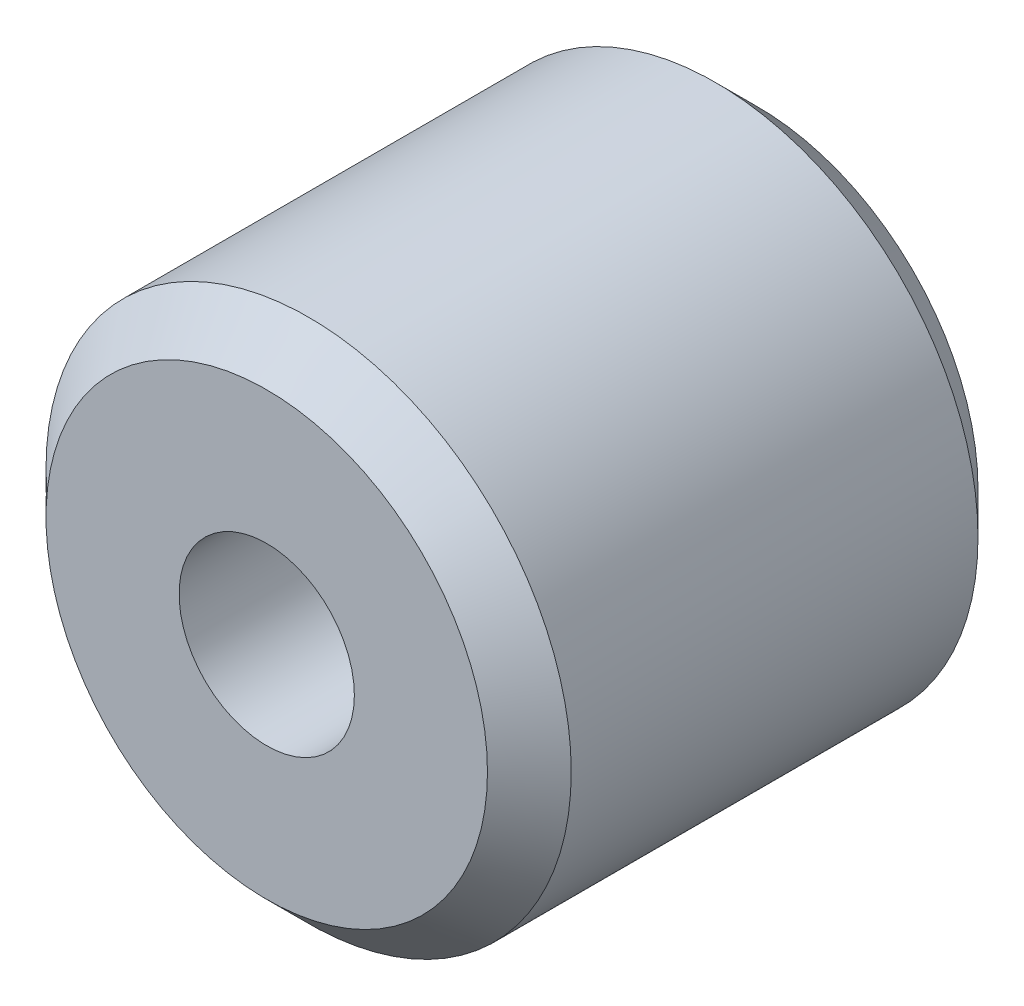
ISO-10303-21;
HEADER;
FILE_DESCRIPTION(('STEP AP214'),'2;1');
FILE_NAME('part.step','',(''),(''),'','','');
FILE_SCHEMA(('AUTOMOTIVE_DESIGN { 1 0 10303 214 1 1 1 1 }'));
ENDSEC;
DATA;
#1=APPLICATION_CONTEXT('core data for automotive mechanical design processes');
#2=APPLICATION_PROTOCOL_DEFINITION('international standard','automotive_design',2000,#1);
#3=PRODUCT_CONTEXT('',#1,'mechanical');
#4=PRODUCT('Part','Part','',(#3));
#5=PRODUCT_RELATED_PRODUCT_CATEGORY('part','',(#4));
#6=PRODUCT_DEFINITION_FORMATION('','',#4);
#7=PRODUCT_DEFINITION_CONTEXT('part definition',#1,'design');
#8=PRODUCT_DEFINITION('design','',#6,#7);
#9=PRODUCT_DEFINITION_SHAPE('','',#8);
#10=(LENGTH_UNIT() NAMED_UNIT(*) SI_UNIT(.MILLI.,.METRE.));
#11=(NAMED_UNIT(*) PLANE_ANGLE_UNIT() SI_UNIT($,.RADIAN.));
#12=(NAMED_UNIT(*) SI_UNIT($,.STERADIAN.) SOLID_ANGLE_UNIT());
#13=UNCERTAINTY_MEASURE_WITH_UNIT(LENGTH_MEASURE(1.E-05),#10,'distance_accuracy_value','');
#14=(GEOMETRIC_REPRESENTATION_CONTEXT(3) GLOBAL_UNCERTAINTY_ASSIGNED_CONTEXT((#13)) GLOBAL_UNIT_ASSIGNED_CONTEXT((#10,
#11,#12)) REPRESENTATION_CONTEXT('',''));
#15=CARTESIAN_POINT('',(0.,0.,0.));
#16=DIRECTION('',(0.,0.,1.));
#17=DIRECTION('',(1.,0.,0.));
#18=AXIS2_PLACEMENT_3D('',#15,#16,#17);
#19=CARTESIAN_POINT('',(0.,0.,4.45));
#20=DIRECTION('',(0.,0.,1.));
#21=DIRECTION('',(1.,0.,0.));
#22=AXIS2_PLACEMENT_3D('',#19,#20,#21);
#23=PLANE('',#22);
#24=CARTESIAN_POINT('',(0.,0.,4.45));
#25=DIRECTION('',(0.,0.,1.));
#26=DIRECTION('',(1.,0.,0.));
#27=AXIS2_PLACEMENT_3D('',#24,#25,#26);
#28=CIRCLE('',#27,4.005);
#29=CARTESIAN_POINT('',(4.005,0.,4.45));
#30=VERTEX_POINT('',#29);
#31=EDGE_CURVE('E10',#30,#30,#28,.T.);
#32=ORIENTED_EDGE('',*,*,#31,.T.);
#33=EDGE_LOOP('',(#32));
#34=FACE_BOUND('',#33,.T.);
#35=CARTESIAN_POINT('',(0.,0.,4.45));
#36=DIRECTION('',(0.,0.,1.));
#37=DIRECTION('',(1.,0.,0.));
#38=AXIS2_PLACEMENT_3D('',#35,#36,#37);
#39=CIRCLE('',#38,1.59);
#40=CARTESIAN_POINT('',(1.59,0.,4.45));
#41=VERTEX_POINT('',#40);
#42=EDGE_CURVE('E68',#41,#41,#39,.T.);
#43=ORIENTED_EDGE('',*,*,#42,.F.);
#44=EDGE_LOOP('',(#43));
#45=FACE_BOUND('',#44,.T.);
#46=ADVANCED_FACE('F43',(#34,#45),#23,.T.);
#47=CARTESIAN_POINT('',(0.,0.,-4.45));
#48=DIRECTION('',(0.,0.,1.));
#49=DIRECTION('',(1.,0.,0.));
#50=AXIS2_PLACEMENT_3D('',#47,#48,#49);
#51=PLANE('',#50);
#52=CARTESIAN_POINT('',(0.,0.,-4.45));
#53=DIRECTION('',(0.,0.,1.));
#54=DIRECTION('',(1.,0.,0.));
#55=AXIS2_PLACEMENT_3D('',#52,#53,#54);
#56=CIRCLE('',#55,4.00499999999999);
#57=CARTESIAN_POINT('',(4.00499999999999,0.,-4.45));
#58=VERTEX_POINT('',#57);
#59=EDGE_CURVE('E52',#58,#58,#56,.F.);
#60=ORIENTED_EDGE('',*,*,#59,.T.);
#61=EDGE_LOOP('',(#60));
#62=FACE_BOUND('',#61,.T.);
#63=CARTESIAN_POINT('',(0.,0.,-4.45));
#64=DIRECTION('',(0.,0.,1.));
#65=DIRECTION('',(1.,0.,0.));
#66=AXIS2_PLACEMENT_3D('',#63,#64,#65);
#67=CIRCLE('',#66,1.59);
#68=CARTESIAN_POINT('',(1.59,0.,-4.45));
#69=VERTEX_POINT('',#68);
#70=EDGE_CURVE('E69',#69,#69,#67,.T.);
#71=ORIENTED_EDGE('',*,*,#70,.T.);
#72=EDGE_LOOP('',(#71));
#73=FACE_BOUND('',#72,.T.);
#74=ADVANCED_FACE('F81',(#62,#73),#51,.F.);
#75=CARTESIAN_POINT('',(0.,0.,4.45));
#76=DIRECTION('',(0.,0.,-1.));
#77=DIRECTION('',(-1.,0.,0.));
#78=AXIS2_PLACEMENT_3D('',#75,#76,#77);
#79=CYLINDRICAL_SURFACE('',#78,4.765);
#80=CARTESIAN_POINT('',(0.,0.,-3.69));
#81=DIRECTION('',(0.,0.,1.));
#82=DIRECTION('',(1.,0.,0.));
#83=AXIS2_PLACEMENT_3D('',#80,#81,#82);
#84=CIRCLE('',#83,4.765);
#85=CARTESIAN_POINT('',(4.765,0.,-3.69));
#86=VERTEX_POINT('',#85);
#87=EDGE_CURVE('E57',#86,#86,#84,.T.);
#88=ORIENTED_EDGE('',*,*,#87,.T.);
#89=EDGE_LOOP('',(#88));
#90=FACE_BOUND('',#89,.T.);
#91=CARTESIAN_POINT('',(0.,0.,3.69));
#92=DIRECTION('',(0.,0.,1.));
#93=DIRECTION('',(1.,0.,0.));
#94=AXIS2_PLACEMENT_3D('',#91,#92,#93);
#95=CIRCLE('',#94,4.765);
#96=CARTESIAN_POINT('',(4.765,0.,3.69));
#97=VERTEX_POINT('',#96);
#98=EDGE_CURVE('E62',#97,#97,#95,.F.);
#99=ORIENTED_EDGE('',*,*,#98,.T.);
#100=EDGE_LOOP('',(#99));
#101=FACE_BOUND('',#100,.T.);
#102=ADVANCED_FACE('F86',(#90,#101),#79,.T.);
#103=CARTESIAN_POINT('',(0.,0.,4.45));
#104=DIRECTION('',(0.,0.,-1.));
#105=DIRECTION('',(-1.,0.,0.));
#106=AXIS2_PLACEMENT_3D('',#103,#104,#105);
#107=CYLINDRICAL_SURFACE('',#106,1.59);
#108=ORIENTED_EDGE('',*,*,#42,.T.);
#109=EDGE_LOOP('',(#108));
#110=FACE_BOUND('',#109,.T.);
#111=ORIENTED_EDGE('',*,*,#70,.F.);
#112=EDGE_LOOP('',(#111));
#113=FACE_BOUND('',#112,.T.);
#114=ADVANCED_FACE('F77',(#110,#113),#107,.F.);
#115=CARTESIAN_POINT('',(0.,0.,-3.69));
#116=DIRECTION('',(0.,0.,1.));
#117=DIRECTION('',(1.,0.,0.));
#118=AXIS2_PLACEMENT_3D('',#115,#116,#117);
#119=CONICAL_SURFACE('',#118,4.765,0.78539816339745);
#120=ORIENTED_EDGE('',*,*,#59,.F.);
#121=EDGE_LOOP('',(#120));
#122=FACE_BOUND('',#121,.T.);
#123=ORIENTED_EDGE('',*,*,#87,.F.);
#124=EDGE_LOOP('',(#123));
#125=FACE_BOUND('',#124,.T.);
#126=ADVANCED_FACE('F93',(#122,#125),#119,.T.);
#127=CARTESIAN_POINT('',(0.,0.,4.45));
#128=DIRECTION('',(0.,0.,-1.));
#129=DIRECTION('',(-1.,0.,0.));
#130=AXIS2_PLACEMENT_3D('',#127,#128,#129);
#131=CONICAL_SURFACE('',#130,4.005,0.785398163397447);
#132=ORIENTED_EDGE('',*,*,#98,.F.);
#133=EDGE_LOOP('',(#132));
#134=FACE_BOUND('',#133,.T.);
#135=ORIENTED_EDGE('',*,*,#31,.F.);
#136=EDGE_LOOP('',(#135));
#137=FACE_BOUND('',#136,.T.);
#138=ADVANCED_FACE('F46',(#134,#137),#131,.T.);
#139=CLOSED_SHELL('',(#46,#74,#102,#114,#126,#138));
#140=MANIFOLD_SOLID_BREP('B2',#139);
#141=ADVANCED_BREP_SHAPE_REPRESENTATION('',(#18,#140),#14);
#142=SHAPE_DEFINITION_REPRESENTATION(#9,#141);
ENDSEC;
END-ISO-10303-21;
